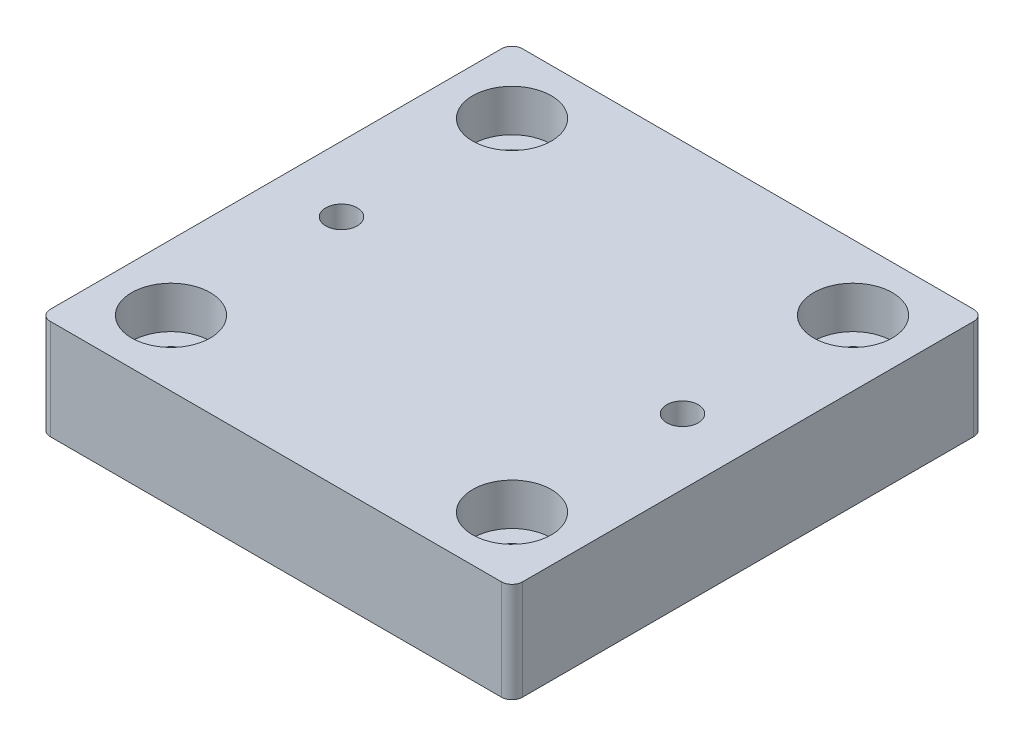
ISO-10303-21;
HEADER;
FILE_DESCRIPTION(('STEP AP214'),'2;1');
FILE_NAME('part.step','',(''),(''),'','','');
FILE_SCHEMA(('AUTOMOTIVE_DESIGN { 1 0 10303 214 1 1 1 1 }'));
ENDSEC;
DATA;
#1=APPLICATION_CONTEXT('core data for automotive mechanical design processes');
#2=APPLICATION_PROTOCOL_DEFINITION('international standard','automotive_design',2000,#1);
#3=PRODUCT_CONTEXT('',#1,'mechanical');
#4=PRODUCT('Part','Part','',(#3));
#5=PRODUCT_RELATED_PRODUCT_CATEGORY('part','',(#4));
#6=PRODUCT_DEFINITION_FORMATION('','',#4);
#7=PRODUCT_DEFINITION_CONTEXT('part definition',#1,'design');
#8=PRODUCT_DEFINITION('design','',#6,#7);
#9=PRODUCT_DEFINITION_SHAPE('','',#8);
#10=(LENGTH_UNIT() NAMED_UNIT(*) SI_UNIT(.MILLI.,.METRE.));
#11=(NAMED_UNIT(*) PLANE_ANGLE_UNIT() SI_UNIT($,.RADIAN.));
#12=(NAMED_UNIT(*) SI_UNIT($,.STERADIAN.) SOLID_ANGLE_UNIT());
#13=UNCERTAINTY_MEASURE_WITH_UNIT(LENGTH_MEASURE(1.E-05),#10,'distance_accuracy_value','');
#14=(GEOMETRIC_REPRESENTATION_CONTEXT(3) GLOBAL_UNCERTAINTY_ASSIGNED_CONTEXT((#13)) GLOBAL_UNIT_ASSIGNED_CONTEXT((#10,
#11,#12)) REPRESENTATION_CONTEXT('',''));
#15=CARTESIAN_POINT('',(0.,0.,0.));
#16=DIRECTION('',(0.,0.,1.));
#17=DIRECTION('',(1.,0.,0.));
#18=AXIS2_PLACEMENT_3D('',#15,#16,#17);
#19=CARTESIAN_POINT('',(-32.5,19.05,-32.5));
#20=DIRECTION('',(0.,-1.,0.));
#21=DIRECTION('',(0.,0.,-1.));
#22=AXIS2_PLACEMENT_3D('',#19,#20,#21);
#23=CYLINDRICAL_SURFACE('',#22,4.);
#24=CARTESIAN_POINT('',(-32.5,0.,-32.5));
#25=DIRECTION('',(0.,1.,0.));
#26=DIRECTION('',(0.,0.,1.));
#27=AXIS2_PLACEMENT_3D('',#24,#25,#26);
#28=CIRCLE('',#27,4.);
#29=CARTESIAN_POINT('',(-32.5,0.,-28.5));
#30=VERTEX_POINT('',#29);
#31=EDGE_CURVE('E155',#30,#30,#28,.T.);
#32=ORIENTED_EDGE('',*,*,#31,.F.);
#33=EDGE_LOOP('',(#32));
#34=FACE_BOUND('',#33,.T.);
#35=CARTESIAN_POINT('',(-32.5,11.05,-32.5));
#36=DIRECTION('',(0.,1.,0.));
#37=DIRECTION('',(0.,0.,1.));
#38=AXIS2_PLACEMENT_3D('',#35,#36,#37);
#39=CIRCLE('',#38,4.);
#40=CARTESIAN_POINT('',(-32.5,11.05,-28.5));
#41=VERTEX_POINT('',#40);
#42=EDGE_CURVE('E49',#41,#41,#39,.T.);
#43=ORIENTED_EDGE('',*,*,#42,.T.);
#44=EDGE_LOOP('',(#43));
#45=FACE_BOUND('',#44,.T.);
#46=ADVANCED_FACE('F45',(#34,#45),#23,.F.);
#47=CARTESIAN_POINT('',(32.5,19.05,-32.5));
#48=DIRECTION('',(0.,-1.,0.));
#49=DIRECTION('',(0.,0.,-1.));
#50=AXIS2_PLACEMENT_3D('',#47,#48,#49);
#51=CYLINDRICAL_SURFACE('',#50,4.00000000000001);
#52=CARTESIAN_POINT('',(32.5,0.,-32.5));
#53=DIRECTION('',(0.,1.,0.));
#54=DIRECTION('',(0.,0.,1.));
#55=AXIS2_PLACEMENT_3D('',#52,#53,#54);
#56=CIRCLE('',#55,4.00000000000001);
#57=CARTESIAN_POINT('',(32.5,0.,-28.5));
#58=VERTEX_POINT('',#57);
#59=EDGE_CURVE('E236',#58,#58,#56,.T.);
#60=ORIENTED_EDGE('',*,*,#59,.F.);
#61=EDGE_LOOP('',(#60));
#62=FACE_BOUND('',#61,.T.);
#63=CARTESIAN_POINT('',(32.5,11.05,-32.5));
#64=DIRECTION('',(0.,1.,0.));
#65=DIRECTION('',(0.,0.,1.));
#66=AXIS2_PLACEMENT_3D('',#63,#64,#65);
#67=CIRCLE('',#66,4.00000000000001);
#68=CARTESIAN_POINT('',(32.5,11.05,-28.5));
#69=VERTEX_POINT('',#68);
#70=EDGE_CURVE('E199',#69,#69,#67,.T.);
#71=ORIENTED_EDGE('',*,*,#70,.T.);
#72=EDGE_LOOP('',(#71));
#73=FACE_BOUND('',#72,.T.);
#74=ADVANCED_FACE('F285',(#62,#73),#51,.F.);
#75=CARTESIAN_POINT('',(32.5,19.05,32.5));
#76=DIRECTION('',(0.,-1.,0.));
#77=DIRECTION('',(0.,0.,-1.));
#78=AXIS2_PLACEMENT_3D('',#75,#76,#77);
#79=CYLINDRICAL_SURFACE('',#78,4.00000000000001);
#80=CARTESIAN_POINT('',(32.5,0.,32.5));
#81=DIRECTION('',(0.,1.,0.));
#82=DIRECTION('',(0.,0.,1.));
#83=AXIS2_PLACEMENT_3D('',#80,#81,#82);
#84=CIRCLE('',#83,4.00000000000001);
#85=CARTESIAN_POINT('',(32.5,0.,36.5));
#86=VERTEX_POINT('',#85);
#87=EDGE_CURVE('E232',#86,#86,#84,.T.);
#88=ORIENTED_EDGE('',*,*,#87,.F.);
#89=EDGE_LOOP('',(#88));
#90=FACE_BOUND('',#89,.T.);
#91=CARTESIAN_POINT('',(32.5,11.05,32.5));
#92=DIRECTION('',(0.,1.,0.));
#93=DIRECTION('',(0.,0.,1.));
#94=AXIS2_PLACEMENT_3D('',#91,#92,#93);
#95=CIRCLE('',#94,4.00000000000001);
#96=CARTESIAN_POINT('',(32.5,11.05,36.5));
#97=VERTEX_POINT('',#96);
#98=EDGE_CURVE('E195',#97,#97,#95,.T.);
#99=ORIENTED_EDGE('',*,*,#98,.T.);
#100=EDGE_LOOP('',(#99));
#101=FACE_BOUND('',#100,.T.);
#102=ADVANCED_FACE('F292',(#90,#101),#79,.F.);
#103=CARTESIAN_POINT('',(-32.5,19.05,32.5));
#104=DIRECTION('',(0.,-1.,0.));
#105=DIRECTION('',(0.,0.,-1.));
#106=AXIS2_PLACEMENT_3D('',#103,#104,#105);
#107=CYLINDRICAL_SURFACE('',#106,4.);
#108=CARTESIAN_POINT('',(-32.5,0.,32.5));
#109=DIRECTION('',(0.,1.,0.));
#110=DIRECTION('',(0.,0.,1.));
#111=AXIS2_PLACEMENT_3D('',#108,#109,#110);
#112=CIRCLE('',#111,4.);
#113=CARTESIAN_POINT('',(-32.5,0.,36.5));
#114=VERTEX_POINT('',#113);
#115=EDGE_CURVE('E225',#114,#114,#112,.T.);
#116=ORIENTED_EDGE('',*,*,#115,.F.);
#117=EDGE_LOOP('',(#116));
#118=FACE_BOUND('',#117,.T.);
#119=CARTESIAN_POINT('',(-32.5,11.05,32.5));
#120=DIRECTION('',(0.,1.,0.));
#121=DIRECTION('',(0.,0.,1.));
#122=AXIS2_PLACEMENT_3D('',#119,#120,#121);
#123=CIRCLE('',#122,4.);
#124=CARTESIAN_POINT('',(-32.5,11.05,36.5));
#125=VERTEX_POINT('',#124);
#126=EDGE_CURVE('E191',#125,#125,#123,.T.);
#127=ORIENTED_EDGE('',*,*,#126,.T.);
#128=EDGE_LOOP('',(#127));
#129=FACE_BOUND('',#128,.T.);
#130=ADVANCED_FACE('F299',(#118,#129),#107,.F.);
#131=CARTESIAN_POINT('',(-43.,19.05,43.));
#132=DIRECTION('',(0.,-1.,0.));
#133=DIRECTION('',(0.,0.,-1.));
#134=AXIS2_PLACEMENT_3D('',#131,#132,#133);
#135=PLANE('',#134);
#136=CARTESIAN_POINT('',(-32.5,19.05,-32.5));
#137=DIRECTION('',(0.,1.,0.));
#138=DIRECTION('',(0.,0.,1.));
#139=AXIS2_PLACEMENT_3D('',#136,#137,#138);
#140=CIRCLE('',#139,7.5);
#141=CARTESIAN_POINT('',(-32.5,19.05,-25.));
#142=VERTEX_POINT('',#141);
#143=EDGE_CURVE('E342',#142,#142,#140,.T.);
#144=ORIENTED_EDGE('',*,*,#143,.F.);
#145=EDGE_LOOP('',(#144));
#146=FACE_BOUND('',#145,.T.);
#147=CARTESIAN_POINT('',(32.5,19.05,-32.5));
#148=DIRECTION('',(0.,1.,0.));
#149=DIRECTION('',(0.,0.,1.));
#150=AXIS2_PLACEMENT_3D('',#147,#148,#149);
#151=CIRCLE('',#150,7.5);
#152=CARTESIAN_POINT('',(32.5,19.05,-25.));
#153=VERTEX_POINT('',#152);
#154=EDGE_CURVE('E328',#153,#153,#151,.T.);
#155=ORIENTED_EDGE('',*,*,#154,.F.);
#156=EDGE_LOOP('',(#155));
#157=FACE_BOUND('',#156,.T.);
#158=CARTESIAN_POINT('',(32.5,19.05,32.5));
#159=DIRECTION('',(0.,1.,0.));
#160=DIRECTION('',(0.,0.,1.));
#161=AXIS2_PLACEMENT_3D('',#158,#159,#160);
#162=CIRCLE('',#161,7.5);
#163=CARTESIAN_POINT('',(32.5,19.05,40.));
#164=VERTEX_POINT('',#163);
#165=EDGE_CURVE('E327',#164,#164,#162,.T.);
#166=ORIENTED_EDGE('',*,*,#165,.F.);
#167=EDGE_LOOP('',(#166));
#168=FACE_BOUND('',#167,.T.);
#169=CARTESIAN_POINT('',(-32.5,19.05,32.5));
#170=DIRECTION('',(0.,1.,0.));
#171=DIRECTION('',(0.,0.,1.));
#172=AXIS2_PLACEMENT_3D('',#169,#170,#171);
#173=CIRCLE('',#172,7.5);
#174=CARTESIAN_POINT('',(-32.5,19.05,40.));
#175=VERTEX_POINT('',#174);
#176=EDGE_CURVE('E333',#175,#175,#173,.T.);
#177=ORIENTED_EDGE('',*,*,#176,.F.);
#178=EDGE_LOOP('',(#177));
#179=FACE_BOUND('',#178,.T.);
#180=CARTESIAN_POINT('',(-43.,19.05,43.));
#181=DIRECTION('',(0.,1.,0.));
#182=DIRECTION('',(0.,0.,-1.));
#183=AXIS2_PLACEMENT_3D('',#180,#181,#182);
#184=CIRCLE('',#183,2.);
#185=CARTESIAN_POINT('',(-45.,19.05,43.));
#186=VERTEX_POINT('',#185);
#187=CARTESIAN_POINT('',(-43.,19.05,45.));
#188=VERTEX_POINT('',#187);
#189=EDGE_CURVE('E173',#186,#188,#184,.T.);
#190=ORIENTED_EDGE('',*,*,#189,.T.);
#191=DIRECTION('',(1.,0.,0.));
#192=VECTOR('',#191,1.);
#193=CARTESIAN_POINT('',(-43.,19.05,45.));
#194=LINE('',#193,#192);
#195=CARTESIAN_POINT('',(43.,19.05,45.));
#196=VERTEX_POINT('',#195);
#197=EDGE_CURVE('E108',#188,#196,#194,.T.);
#198=ORIENTED_EDGE('',*,*,#197,.T.);
#199=CARTESIAN_POINT('',(43.,19.05,43.));
#200=DIRECTION('',(0.,1.,0.));
#201=DIRECTION('',(0.,0.,1.));
#202=AXIS2_PLACEMENT_3D('',#199,#200,#201);
#203=CIRCLE('',#202,2.);
#204=CARTESIAN_POINT('',(45.,19.05,43.));
#205=VERTEX_POINT('',#204);
#206=EDGE_CURVE('E247',#196,#205,#203,.T.);
#207=ORIENTED_EDGE('',*,*,#206,.T.);
#208=DIRECTION('',(0.,0.,-1.));
#209=VECTOR('',#208,1.);
#210=CARTESIAN_POINT('',(45.,19.05,43.));
#211=LINE('',#210,#209);
#212=CARTESIAN_POINT('',(45.,19.05,-43.));
#213=VERTEX_POINT('',#212);
#214=EDGE_CURVE('E250',#205,#213,#211,.T.);
#215=ORIENTED_EDGE('',*,*,#214,.T.);
#216=CARTESIAN_POINT('',(43.,19.05,-43.));
#217=DIRECTION('',(0.,1.,0.));
#218=DIRECTION('',(0.,0.,-1.));
#219=AXIS2_PLACEMENT_3D('',#216,#217,#218);
#220=CIRCLE('',#219,2.);
#221=CARTESIAN_POINT('',(43.,19.05,-45.));
#222=VERTEX_POINT('',#221);
#223=EDGE_CURVE('E128',#213,#222,#220,.T.);
#224=ORIENTED_EDGE('',*,*,#223,.T.);
#225=DIRECTION('',(-1.,0.,0.));
#226=VECTOR('',#225,1.);
#227=CARTESIAN_POINT('',(-43.,19.05,-45.));
#228=LINE('',#227,#226);
#229=CARTESIAN_POINT('',(-43.,19.05,-45.));
#230=VERTEX_POINT('',#229);
#231=EDGE_CURVE('E121',#222,#230,#228,.T.);
#232=ORIENTED_EDGE('',*,*,#231,.T.);
#233=CARTESIAN_POINT('',(-43.,19.05,-43.));
#234=DIRECTION('',(0.,1.,0.));
#235=DIRECTION('',(0.,0.,-1.));
#236=AXIS2_PLACEMENT_3D('',#233,#234,#235);
#237=CIRCLE('',#236,2.);
#238=CARTESIAN_POINT('',(-45.,19.05,-43.));
#239=VERTEX_POINT('',#238);
#240=EDGE_CURVE('E126',#230,#239,#237,.T.);
#241=ORIENTED_EDGE('',*,*,#240,.T.);
#242=DIRECTION('',(0.,0.,1.));
#243=VECTOR('',#242,1.);
#244=CARTESIAN_POINT('',(-45.,19.05,43.));
#245=LINE('',#244,#243);
#246=EDGE_CURVE('E65',#239,#186,#245,.T.);
#247=ORIENTED_EDGE('',*,*,#246,.T.);
#248=EDGE_LOOP('',(#190,#198,#207,#215,#224,#232,#241,#247));
#249=FACE_BOUND('',#248,.T.);
#250=CARTESIAN_POINT('',(-32.5,19.05,0.));
#251=DIRECTION('',(0.,1.,0.));
#252=DIRECTION('',(0.,0.,1.));
#253=AXIS2_PLACEMENT_3D('',#250,#251,#252);
#254=CIRCLE('',#253,3.);
#255=CARTESIAN_POINT('',(-32.5,19.05,3.));
#256=VERTEX_POINT('',#255);
#257=EDGE_CURVE('E221',#256,#256,#254,.T.);
#258=ORIENTED_EDGE('',*,*,#257,.F.);
#259=EDGE_LOOP('',(#258));
#260=FACE_BOUND('',#259,.T.);
#261=CARTESIAN_POINT('',(32.5,19.05,0.));
#262=DIRECTION('',(0.,1.,0.));
#263=DIRECTION('',(0.,0.,1.));
#264=AXIS2_PLACEMENT_3D('',#261,#262,#263);
#265=CIRCLE('',#264,3.);
#266=CARTESIAN_POINT('',(32.5,19.05,3.));
#267=VERTEX_POINT('',#266);
#268=EDGE_CURVE('E211',#267,#267,#265,.T.);
#269=ORIENTED_EDGE('',*,*,#268,.F.);
#270=EDGE_LOOP('',(#269));
#271=FACE_BOUND('',#270,.T.);
#272=ADVANCED_FACE('F123',(#146,#157,#168,#179,#249,#260,#271),#135,.F.);
#273=CARTESIAN_POINT('',(-43.,0.,43.));
#274=DIRECTION('',(0.,-1.,0.));
#275=DIRECTION('',(0.,0.,-1.));
#276=AXIS2_PLACEMENT_3D('',#273,#274,#275);
#277=PLANE('',#276);
#278=CARTESIAN_POINT('',(-32.5,0.,0.));
#279=DIRECTION('',(0.,1.,0.));
#280=DIRECTION('',(0.,0.,1.));
#281=AXIS2_PLACEMENT_3D('',#278,#279,#280);
#282=CIRCLE('',#281,3.);
#283=CARTESIAN_POINT('',(-32.5,0.,3.));
#284=VERTEX_POINT('',#283);
#285=EDGE_CURVE('E217',#284,#284,#282,.T.);
#286=ORIENTED_EDGE('',*,*,#285,.T.);
#287=EDGE_LOOP('',(#286));
#288=FACE_BOUND('',#287,.T.);
#289=ORIENTED_EDGE('',*,*,#87,.T.);
#290=EDGE_LOOP('',(#289));
#291=FACE_BOUND('',#290,.T.);
#292=ORIENTED_EDGE('',*,*,#31,.T.);
#293=EDGE_LOOP('',(#292));
#294=FACE_BOUND('',#293,.T.);
#295=CARTESIAN_POINT('',(-43.,0.,43.));
#296=DIRECTION('',(0.,1.,0.));
#297=DIRECTION('',(0.,0.,-1.));
#298=AXIS2_PLACEMENT_3D('',#295,#296,#297);
#299=CIRCLE('',#298,2.);
#300=CARTESIAN_POINT('',(-45.,0.,43.));
#301=VERTEX_POINT('',#300);
#302=CARTESIAN_POINT('',(-43.,0.,45.));
#303=VERTEX_POINT('',#302);
#304=EDGE_CURVE('E150',#301,#303,#299,.T.);
#305=ORIENTED_EDGE('',*,*,#304,.F.);
#306=DIRECTION('',(0.,0.,1.));
#307=VECTOR('',#306,1.);
#308=CARTESIAN_POINT('',(-45.,0.,43.));
#309=LINE('',#308,#307);
#310=CARTESIAN_POINT('',(-45.,0.,-43.));
#311=VERTEX_POINT('',#310);
#312=EDGE_CURVE('E100',#311,#301,#309,.T.);
#313=ORIENTED_EDGE('',*,*,#312,.F.);
#314=CARTESIAN_POINT('',(-43.,0.,-43.));
#315=DIRECTION('',(0.,1.,0.));
#316=DIRECTION('',(0.,0.,-1.));
#317=AXIS2_PLACEMENT_3D('',#314,#315,#316);
#318=CIRCLE('',#317,2.);
#319=CARTESIAN_POINT('',(-43.,0.,-45.));
#320=VERTEX_POINT('',#319);
#321=EDGE_CURVE('E94',#320,#311,#318,.T.);
#322=ORIENTED_EDGE('',*,*,#321,.F.);
#323=DIRECTION('',(-1.,0.,0.));
#324=VECTOR('',#323,1.);
#325=CARTESIAN_POINT('',(-43.,0.,-45.));
#326=LINE('',#325,#324);
#327=CARTESIAN_POINT('',(43.,0.,-45.));
#328=VERTEX_POINT('',#327);
#329=EDGE_CURVE('E137',#328,#320,#326,.T.);
#330=ORIENTED_EDGE('',*,*,#329,.F.);
#331=CARTESIAN_POINT('',(43.,0.,-43.));
#332=DIRECTION('',(0.,1.,0.));
#333=DIRECTION('',(0.,0.,-1.));
#334=AXIS2_PLACEMENT_3D('',#331,#332,#333);
#335=CIRCLE('',#334,2.);
#336=CARTESIAN_POINT('',(45.,0.,-43.));
#337=VERTEX_POINT('',#336);
#338=EDGE_CURVE('E164',#337,#328,#335,.T.);
#339=ORIENTED_EDGE('',*,*,#338,.F.);
#340=DIRECTION('',(0.,0.,-1.));
#341=VECTOR('',#340,1.);
#342=CARTESIAN_POINT('',(45.,0.,43.));
#343=LINE('',#342,#341);
#344=CARTESIAN_POINT('',(45.,0.,43.));
#345=VERTEX_POINT('',#344);
#346=EDGE_CURVE('E161',#345,#337,#343,.T.);
#347=ORIENTED_EDGE('',*,*,#346,.F.);
#348=CARTESIAN_POINT('',(43.,0.,43.));
#349=DIRECTION('',(0.,1.,0.));
#350=DIRECTION('',(0.,0.,1.));
#351=AXIS2_PLACEMENT_3D('',#348,#349,#350);
#352=CIRCLE('',#351,2.);
#353=CARTESIAN_POINT('',(43.,0.,45.));
#354=VERTEX_POINT('',#353);
#355=EDGE_CURVE('E158',#354,#345,#352,.T.);
#356=ORIENTED_EDGE('',*,*,#355,.F.);
#357=DIRECTION('',(1.,0.,0.));
#358=VECTOR('',#357,1.);
#359=CARTESIAN_POINT('',(-43.,0.,45.));
#360=LINE('',#359,#358);
#361=EDGE_CURVE('E154',#303,#354,#360,.T.);
#362=ORIENTED_EDGE('',*,*,#361,.F.);
#363=EDGE_LOOP('',(#305,#313,#322,#330,#339,#347,#356,#362));
#364=FACE_BOUND('',#363,.T.);
#365=ORIENTED_EDGE('',*,*,#59,.T.);
#366=EDGE_LOOP('',(#365));
#367=FACE_BOUND('',#366,.T.);
#368=ORIENTED_EDGE('',*,*,#115,.T.);
#369=EDGE_LOOP('',(#368));
#370=FACE_BOUND('',#369,.T.);
#371=CARTESIAN_POINT('',(32.5,0.,0.));
#372=DIRECTION('',(0.,1.,0.));
#373=DIRECTION('',(0.,0.,1.));
#374=AXIS2_PLACEMENT_3D('',#371,#372,#373);
#375=CIRCLE('',#374,3.);
#376=CARTESIAN_POINT('',(32.5,0.,3.));
#377=VERTEX_POINT('',#376);
#378=EDGE_CURVE('E206',#377,#377,#375,.T.);
#379=ORIENTED_EDGE('',*,*,#378,.T.);
#380=EDGE_LOOP('',(#379));
#381=FACE_BOUND('',#380,.T.);
#382=ADVANCED_FACE('F265',(#288,#291,#294,#364,#367,#370,#381),#277,.T.);
#383=CARTESIAN_POINT('',(-43.,19.05,43.));
#384=DIRECTION('',(0.,-1.,0.));
#385=DIRECTION('',(0.,0.,-1.));
#386=AXIS2_PLACEMENT_3D('',#383,#384,#385);
#387=CYLINDRICAL_SURFACE('',#386,2.);
#388=ORIENTED_EDGE('',*,*,#304,.T.);
#389=DIRECTION('',(0.,-1.,0.));
#390=VECTOR('',#389,1.);
#391=CARTESIAN_POINT('',(-43.,19.05,45.));
#392=LINE('',#391,#390);
#393=EDGE_CURVE('E11',#188,#303,#392,.T.);
#394=ORIENTED_EDGE('',*,*,#393,.F.);
#395=ORIENTED_EDGE('',*,*,#189,.F.);
#396=DIRECTION('',(0.,-1.,0.));
#397=VECTOR('',#396,1.);
#398=CARTESIAN_POINT('',(-45.,19.05,43.));
#399=LINE('',#398,#397);
#400=EDGE_CURVE('E146',#186,#301,#399,.T.);
#401=ORIENTED_EDGE('',*,*,#400,.T.);
#402=EDGE_LOOP('',(#388,#394,#395,#401));
#403=FACE_BOUND('',#402,.T.);
#404=ADVANCED_FACE('F47',(#403),#387,.T.);
#405=CARTESIAN_POINT('',(-43.,19.05,45.));
#406=DIRECTION('',(0.,0.,-1.));
#407=DIRECTION('',(-1.,0.,0.));
#408=AXIS2_PLACEMENT_3D('',#405,#406,#407);
#409=PLANE('',#408);
#410=ORIENTED_EDGE('',*,*,#361,.T.);
#411=DIRECTION('',(0.,-1.,0.));
#412=VECTOR('',#411,1.);
#413=CARTESIAN_POINT('',(43.,19.05,45.));
#414=LINE('',#413,#412);
#415=EDGE_CURVE('E56',#196,#354,#414,.T.);
#416=ORIENTED_EDGE('',*,*,#415,.F.);
#417=ORIENTED_EDGE('',*,*,#197,.F.);
#418=ORIENTED_EDGE('',*,*,#393,.T.);
#419=EDGE_LOOP('',(#410,#416,#417,#418));
#420=FACE_BOUND('',#419,.T.);
#421=ADVANCED_FACE('F306',(#420),#409,.F.);
#422=CARTESIAN_POINT('',(43.,19.05,43.));
#423=DIRECTION('',(0.,-1.,0.));
#424=DIRECTION('',(0.,0.,-1.));
#425=AXIS2_PLACEMENT_3D('',#422,#423,#424);
#426=CYLINDRICAL_SURFACE('',#425,2.);
#427=ORIENTED_EDGE('',*,*,#355,.T.);
#428=DIRECTION('',(0.,-1.,0.));
#429=VECTOR('',#428,1.);
#430=CARTESIAN_POINT('',(45.,19.05,43.));
#431=LINE('',#430,#429);
#432=EDGE_CURVE('E184',#205,#345,#431,.T.);
#433=ORIENTED_EDGE('',*,*,#432,.F.);
#434=ORIENTED_EDGE('',*,*,#206,.F.);
#435=ORIENTED_EDGE('',*,*,#415,.T.);
#436=EDGE_LOOP('',(#427,#433,#434,#435));
#437=FACE_BOUND('',#436,.T.);
#438=ADVANCED_FACE('F408',(#437),#426,.T.);
#439=CARTESIAN_POINT('',(45.,19.05,43.));
#440=DIRECTION('',(-1.,0.,0.));
#441=DIRECTION('',(0.,0.,1.));
#442=AXIS2_PLACEMENT_3D('',#439,#440,#441);
#443=PLANE('',#442);
#444=ORIENTED_EDGE('',*,*,#346,.T.);
#445=DIRECTION('',(0.,-1.,0.));
#446=VECTOR('',#445,1.);
#447=CARTESIAN_POINT('',(45.,19.05,-43.));
#448=LINE('',#447,#446);
#449=EDGE_CURVE('E180',#213,#337,#448,.T.);
#450=ORIENTED_EDGE('',*,*,#449,.F.);
#451=ORIENTED_EDGE('',*,*,#214,.F.);
#452=ORIENTED_EDGE('',*,*,#432,.T.);
#453=EDGE_LOOP('',(#444,#450,#451,#452));
#454=FACE_BOUND('',#453,.T.);
#455=ADVANCED_FACE('F258',(#454),#443,.F.);
#456=CARTESIAN_POINT('',(43.,19.05,-43.));
#457=DIRECTION('',(0.,-1.,0.));
#458=DIRECTION('',(0.,0.,-1.));
#459=AXIS2_PLACEMENT_3D('',#456,#457,#458);
#460=CYLINDRICAL_SURFACE('',#459,2.);
#461=ORIENTED_EDGE('',*,*,#338,.T.);
#462=DIRECTION('',(0.,-1.,0.));
#463=VECTOR('',#462,1.);
#464=CARTESIAN_POINT('',(43.,19.05,-45.));
#465=LINE('',#464,#463);
#466=EDGE_CURVE('E139',#222,#328,#465,.T.);
#467=ORIENTED_EDGE('',*,*,#466,.F.);
#468=ORIENTED_EDGE('',*,*,#223,.F.);
#469=ORIENTED_EDGE('',*,*,#449,.T.);
#470=EDGE_LOOP('',(#461,#467,#468,#469));
#471=FACE_BOUND('',#470,.T.);
#472=ADVANCED_FACE('F262',(#471),#460,.T.);
#473=CARTESIAN_POINT('',(-43.,19.05,-45.));
#474=DIRECTION('',(0.,0.,1.));
#475=DIRECTION('',(1.,0.,0.));
#476=AXIS2_PLACEMENT_3D('',#473,#474,#475);
#477=PLANE('',#476);
#478=ORIENTED_EDGE('',*,*,#329,.T.);
#479=DIRECTION('',(0.,-1.,0.));
#480=VECTOR('',#479,1.);
#481=CARTESIAN_POINT('',(-43.,19.05,-45.));
#482=LINE('',#481,#480);
#483=EDGE_CURVE('E134',#230,#320,#482,.T.);
#484=ORIENTED_EDGE('',*,*,#483,.F.);
#485=ORIENTED_EDGE('',*,*,#231,.F.);
#486=ORIENTED_EDGE('',*,*,#466,.T.);
#487=EDGE_LOOP('',(#478,#484,#485,#486));
#488=FACE_BOUND('',#487,.T.);
#489=ADVANCED_FACE('F135',(#488),#477,.F.);
#490=CARTESIAN_POINT('',(-43.,19.05,-43.));
#491=DIRECTION('',(0.,-1.,0.));
#492=DIRECTION('',(0.,0.,-1.));
#493=AXIS2_PLACEMENT_3D('',#490,#491,#492);
#494=CYLINDRICAL_SURFACE('',#493,2.);
#495=ORIENTED_EDGE('',*,*,#321,.T.);
#496=DIRECTION('',(0.,-1.,0.));
#497=VECTOR('',#496,1.);
#498=CARTESIAN_POINT('',(-45.,19.05,-43.));
#499=LINE('',#498,#497);
#500=EDGE_CURVE('E140',#239,#311,#499,.T.);
#501=ORIENTED_EDGE('',*,*,#500,.F.);
#502=ORIENTED_EDGE('',*,*,#240,.F.);
#503=ORIENTED_EDGE('',*,*,#483,.T.);
#504=EDGE_LOOP('',(#495,#501,#502,#503));
#505=FACE_BOUND('',#504,.T.);
#506=ADVANCED_FACE('F142',(#505),#494,.T.);
#507=CARTESIAN_POINT('',(-45.,19.05,43.));
#508=DIRECTION('',(1.,0.,0.));
#509=DIRECTION('',(0.,0.,-1.));
#510=AXIS2_PLACEMENT_3D('',#507,#508,#509);
#511=PLANE('',#510);
#512=ORIENTED_EDGE('',*,*,#312,.T.);
#513=ORIENTED_EDGE('',*,*,#400,.F.);
#514=ORIENTED_EDGE('',*,*,#246,.F.);
#515=ORIENTED_EDGE('',*,*,#500,.T.);
#516=EDGE_LOOP('',(#512,#513,#514,#515));
#517=FACE_BOUND('',#516,.T.);
#518=ADVANCED_FACE('F271',(#517),#511,.F.);
#519=CARTESIAN_POINT('',(-32.5,19.05,0.));
#520=DIRECTION('',(0.,-1.,0.));
#521=DIRECTION('',(0.,0.,-1.));
#522=AXIS2_PLACEMENT_3D('',#519,#520,#521);
#523=CYLINDRICAL_SURFACE('',#522,3.);
#524=ORIENTED_EDGE('',*,*,#257,.T.);
#525=EDGE_LOOP('',(#524));
#526=FACE_BOUND('',#525,.T.);
#527=ORIENTED_EDGE('',*,*,#285,.F.);
#528=EDGE_LOOP('',(#527));
#529=FACE_BOUND('',#528,.T.);
#530=ADVANCED_FACE('F273',(#526,#529),#523,.F.);
#531=CARTESIAN_POINT('',(32.5,19.05,0.));
#532=DIRECTION('',(0.,-1.,0.));
#533=DIRECTION('',(0.,0.,-1.));
#534=AXIS2_PLACEMENT_3D('',#531,#532,#533);
#535=CYLINDRICAL_SURFACE('',#534,3.);
#536=ORIENTED_EDGE('',*,*,#268,.T.);
#537=EDGE_LOOP('',(#536));
#538=FACE_BOUND('',#537,.T.);
#539=ORIENTED_EDGE('',*,*,#378,.F.);
#540=EDGE_LOOP('',(#539));
#541=FACE_BOUND('',#540,.T.);
#542=ADVANCED_FACE('F279',(#538,#541),#535,.F.);
#543=CARTESIAN_POINT('',(-32.5,11.05,32.5));
#544=DIRECTION('',(0.,1.,0.));
#545=DIRECTION('',(0.,0.,1.));
#546=AXIS2_PLACEMENT_3D('',#543,#544,#545);
#547=CYLINDRICAL_SURFACE('',#546,7.5);
#548=CARTESIAN_POINT('',(-32.5,11.05,32.5));
#549=DIRECTION('',(0.,1.,0.));
#550=DIRECTION('',(0.,0.,1.));
#551=AXIS2_PLACEMENT_3D('',#548,#549,#550);
#552=CIRCLE('',#551,7.5);
#553=CARTESIAN_POINT('',(-32.5,11.05,40.));
#554=VERTEX_POINT('',#553);
#555=EDGE_CURVE('E196',#554,#554,#552,.T.);
#556=ORIENTED_EDGE('',*,*,#555,.F.);
#557=EDGE_LOOP('',(#556));
#558=FACE_BOUND('',#557,.T.);
#559=ORIENTED_EDGE('',*,*,#176,.T.);
#560=EDGE_LOOP('',(#559));
#561=FACE_BOUND('',#560,.T.);
#562=ADVANCED_FACE('F356',(#558,#561),#547,.F.);
#563=CARTESIAN_POINT('',(-32.5,11.05,32.5));
#564=DIRECTION('',(0.,1.,0.));
#565=DIRECTION('',(0.,0.,1.));
#566=AXIS2_PLACEMENT_3D('',#563,#564,#565);
#567=PLANE('',#566);
#568=ORIENTED_EDGE('',*,*,#126,.F.);
#569=EDGE_LOOP('',(#568));
#570=FACE_BOUND('',#569,.T.);
#571=ORIENTED_EDGE('',*,*,#555,.T.);
#572=EDGE_LOOP('',(#571));
#573=FACE_BOUND('',#572,.T.);
#574=ADVANCED_FACE('F359',(#570,#573),#567,.T.);
#575=CARTESIAN_POINT('',(32.5,11.05,32.5));
#576=DIRECTION('',(0.,1.,0.));
#577=DIRECTION('',(0.,0.,1.));
#578=AXIS2_PLACEMENT_3D('',#575,#576,#577);
#579=CYLINDRICAL_SURFACE('',#578,7.5);
#580=CARTESIAN_POINT('',(32.5,11.05,32.5));
#581=DIRECTION('',(0.,1.,0.));
#582=DIRECTION('',(0.,0.,1.));
#583=AXIS2_PLACEMENT_3D('',#580,#581,#582);
#584=CIRCLE('',#583,7.5);
#585=CARTESIAN_POINT('',(32.5,11.05,40.));
#586=VERTEX_POINT('',#585);
#587=EDGE_CURVE('E324',#586,#586,#584,.T.);
#588=ORIENTED_EDGE('',*,*,#587,.F.);
#589=EDGE_LOOP('',(#588));
#590=FACE_BOUND('',#589,.T.);
#591=ORIENTED_EDGE('',*,*,#165,.T.);
#592=EDGE_LOOP('',(#591));
#593=FACE_BOUND('',#592,.T.);
#594=ADVANCED_FACE('F320',(#590,#593),#579,.F.);
#595=CARTESIAN_POINT('',(32.5,11.05,32.5));
#596=DIRECTION('',(0.,1.,0.));
#597=DIRECTION('',(0.,0.,1.));
#598=AXIS2_PLACEMENT_3D('',#595,#596,#597);
#599=PLANE('',#598);
#600=ORIENTED_EDGE('',*,*,#98,.F.);
#601=EDGE_LOOP('',(#600));
#602=FACE_BOUND('',#601,.T.);
#603=ORIENTED_EDGE('',*,*,#587,.T.);
#604=EDGE_LOOP('',(#603));
#605=FACE_BOUND('',#604,.T.);
#606=ADVANCED_FACE('F316',(#602,#605),#599,.T.);
#607=CARTESIAN_POINT('',(32.5,11.05,-32.5));
#608=DIRECTION('',(0.,1.,0.));
#609=DIRECTION('',(0.,0.,1.));
#610=AXIS2_PLACEMENT_3D('',#607,#608,#609);
#611=CYLINDRICAL_SURFACE('',#610,7.5);
#612=CARTESIAN_POINT('',(32.5,11.05,-32.5));
#613=DIRECTION('',(0.,1.,0.));
#614=DIRECTION('',(0.,0.,1.));
#615=AXIS2_PLACEMENT_3D('',#612,#613,#614);
#616=CIRCLE('',#615,7.5);
#617=CARTESIAN_POINT('',(32.5,11.05,-25.));
#618=VERTEX_POINT('',#617);
#619=EDGE_CURVE('E336',#618,#618,#616,.T.);
#620=ORIENTED_EDGE('',*,*,#619,.F.);
#621=EDGE_LOOP('',(#620));
#622=FACE_BOUND('',#621,.T.);
#623=ORIENTED_EDGE('',*,*,#154,.T.);
#624=EDGE_LOOP('',(#623));
#625=FACE_BOUND('',#624,.T.);
#626=ADVANCED_FACE('F319',(#622,#625),#611,.F.);
#627=CARTESIAN_POINT('',(32.5,11.05,-32.5));
#628=DIRECTION('',(0.,1.,0.));
#629=DIRECTION('',(0.,0.,1.));
#630=AXIS2_PLACEMENT_3D('',#627,#628,#629);
#631=PLANE('',#630);
#632=ORIENTED_EDGE('',*,*,#70,.F.);
#633=EDGE_LOOP('',(#632));
#634=FACE_BOUND('',#633,.T.);
#635=ORIENTED_EDGE('',*,*,#619,.T.);
#636=EDGE_LOOP('',(#635));
#637=FACE_BOUND('',#636,.T.);
#638=ADVANCED_FACE('F509',(#634,#637),#631,.T.);
#639=CARTESIAN_POINT('',(-32.5,11.05,-32.5));
#640=DIRECTION('',(0.,1.,0.));
#641=DIRECTION('',(0.,0.,1.));
#642=AXIS2_PLACEMENT_3D('',#639,#640,#641);
#643=CYLINDRICAL_SURFACE('',#642,7.5);
#644=CARTESIAN_POINT('',(-32.5,11.05,-32.5));
#645=DIRECTION('',(0.,1.,0.));
#646=DIRECTION('',(0.,0.,1.));
#647=AXIS2_PLACEMENT_3D('',#644,#645,#646);
#648=CIRCLE('',#647,7.5);
#649=CARTESIAN_POINT('',(-32.5,11.05,-25.));
#650=VERTEX_POINT('',#649);
#651=EDGE_CURVE('E346',#650,#650,#648,.T.);
#652=ORIENTED_EDGE('',*,*,#651,.F.);
#653=EDGE_LOOP('',(#652));
#654=FACE_BOUND('',#653,.T.);
#655=ORIENTED_EDGE('',*,*,#143,.T.);
#656=EDGE_LOOP('',(#655));
#657=FACE_BOUND('',#656,.T.);
#658=ADVANCED_FACE('F519',(#654,#657),#643,.F.);
#659=CARTESIAN_POINT('',(-32.5,11.05,-32.5));
#660=DIRECTION('',(0.,1.,0.));
#661=DIRECTION('',(0.,0.,1.));
#662=AXIS2_PLACEMENT_3D('',#659,#660,#661);
#663=PLANE('',#662);
#664=ORIENTED_EDGE('',*,*,#42,.F.);
#665=EDGE_LOOP('',(#664));
#666=FACE_BOUND('',#665,.T.);
#667=ORIENTED_EDGE('',*,*,#651,.T.);
#668=EDGE_LOOP('',(#667));
#669=FACE_BOUND('',#668,.T.);
#670=ADVANCED_FACE('F529',(#666,#669),#663,.T.);
#671=CLOSED_SHELL('',(#46,#74,#102,#130,#272,#382,#404,#421,#438,#455,#472,#489,#506,#518,#530,
#542,#562,#574,#594,#606,#626,#638,#658,#670));
#672=MANIFOLD_SOLID_BREP('B2',#671);
#673=ADVANCED_BREP_SHAPE_REPRESENTATION('',(#18,#672),#14);
#674=SHAPE_DEFINITION_REPRESENTATION(#9,#673);
ENDSEC;
END-ISO-10303-21;
